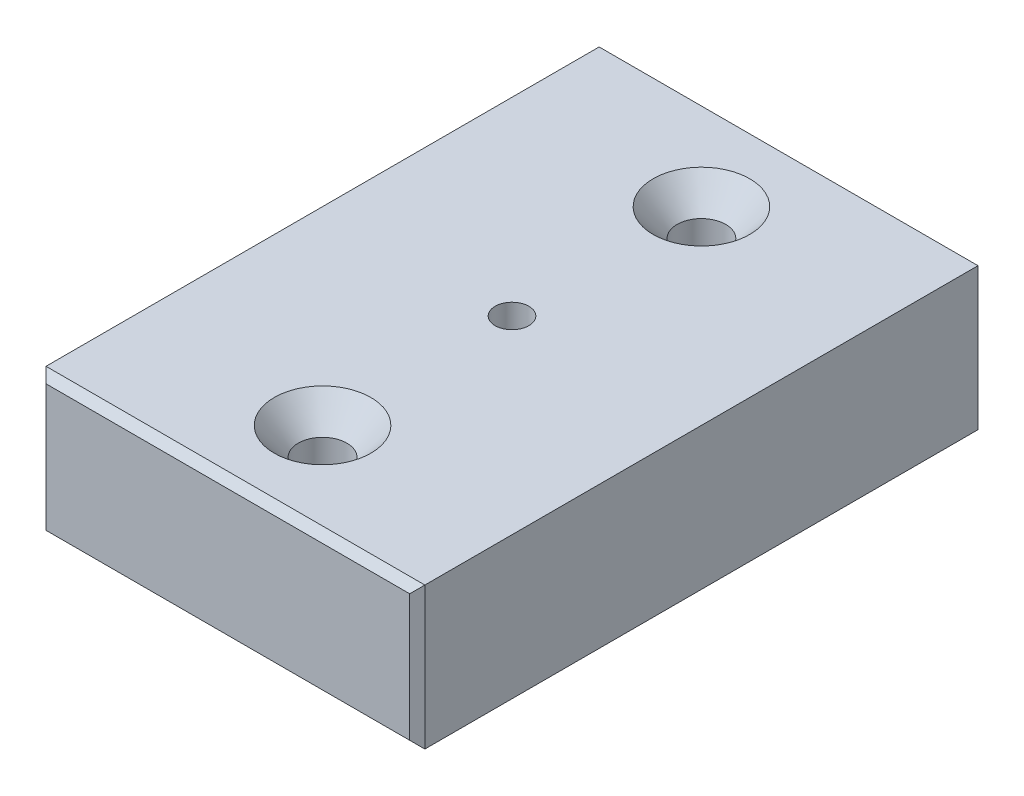
ISO-10303-21;
HEADER;
FILE_DESCRIPTION(('STEP AP214'),'2;1');
FILE_NAME('part.step','',(''),(''),'','','');
FILE_SCHEMA(('AUTOMOTIVE_DESIGN { 1 0 10303 214 1 1 1 1 }'));
ENDSEC;
DATA;
#1=APPLICATION_CONTEXT('core data for automotive mechanical design processes');
#2=APPLICATION_PROTOCOL_DEFINITION('international standard','automotive_design',2000,#1);
#3=PRODUCT_CONTEXT('',#1,'mechanical');
#4=PRODUCT('Part','Part','',(#3));
#5=PRODUCT_RELATED_PRODUCT_CATEGORY('part','',(#4));
#6=PRODUCT_DEFINITION_FORMATION('','',#4);
#7=PRODUCT_DEFINITION_CONTEXT('part definition',#1,'design');
#8=PRODUCT_DEFINITION('design','',#6,#7);
#9=PRODUCT_DEFINITION_SHAPE('','',#8);
#10=(LENGTH_UNIT() NAMED_UNIT(*) SI_UNIT(.MILLI.,.METRE.));
#11=(NAMED_UNIT(*) PLANE_ANGLE_UNIT() SI_UNIT($,.RADIAN.));
#12=(NAMED_UNIT(*) SI_UNIT($,.STERADIAN.) SOLID_ANGLE_UNIT());
#13=UNCERTAINTY_MEASURE_WITH_UNIT(LENGTH_MEASURE(1.E-05),#10,'distance_accuracy_value','');
#14=(GEOMETRIC_REPRESENTATION_CONTEXT(3) GLOBAL_UNCERTAINTY_ASSIGNED_CONTEXT((#13)) GLOBAL_UNIT_ASSIGNED_CONTEXT((#10,
#11,#12)) REPRESENTATION_CONTEXT('',''));
#15=CARTESIAN_POINT('',(0.,0.,0.));
#16=DIRECTION('',(0.,0.,1.));
#17=DIRECTION('',(1.,0.,0.));
#18=AXIS2_PLACEMENT_3D('',#15,#16,#17);
#19=CARTESIAN_POINT('',(12.7,4.7625,38.1));
#20=DIRECTION('',(0.,-1.,0.));
#21=DIRECTION('',(1.,0.,0.));
#22=AXIS2_PLACEMENT_3D('',#19,#20,#21);
#23=PLANE('',#22);
#24=CARTESIAN_POINT('',(0.,4.7625,6.34999999999999));
#25=DIRECTION('',(0.,1.,0.));
#26=DIRECTION('',(0.,0.,1.));
#27=AXIS2_PLACEMENT_3D('',#24,#25,#26);
#28=CIRCLE('',#27,3.2385);
#29=CARTESIAN_POINT('',(0.,4.7625,9.58849999999999));
#30=VERTEX_POINT('',#29);
#31=EDGE_CURVE('E400',#30,#30,#28,.T.);
#32=ORIENTED_EDGE('',*,*,#31,.F.);
#33=EDGE_LOOP('',(#32));
#34=FACE_BOUND('',#33,.T.);
#35=CARTESIAN_POINT('',(0.,4.76249999999999,31.75));
#36=DIRECTION('',(0.,1.,0.));
#37=DIRECTION('',(0.,0.,1.));
#38=AXIS2_PLACEMENT_3D('',#35,#36,#37);
#39=CIRCLE('',#38,3.2385);
#40=CARTESIAN_POINT('',(0.,4.76249999999999,34.9885));
#41=VERTEX_POINT('',#40);
#42=EDGE_CURVE('E362',#41,#41,#39,.T.);
#43=ORIENTED_EDGE('',*,*,#42,.F.);
#44=EDGE_LOOP('',(#43));
#45=FACE_BOUND('',#44,.T.);
#46=DIRECTION('',(0.,0.,-1.));
#47=VECTOR('',#46,1.);
#48=CARTESIAN_POINT('',(-12.7,4.76249999999999,38.1));
#49=LINE('',#48,#47);
#50=CARTESIAN_POINT('',(-12.7,4.76249999999999,37.592));
#51=VERTEX_POINT('',#50);
#52=CARTESIAN_POINT('',(-12.7,4.76249999999999,0.508000000000008));
#53=VERTEX_POINT('',#52);
#54=EDGE_CURVE('E374',#51,#53,#49,.T.);
#55=ORIENTED_EDGE('',*,*,#54,.F.);
#56=DIRECTION('',(1.,0.,0.));
#57=VECTOR('',#56,1.);
#58=CARTESIAN_POINT('',(12.7,4.7625,37.592));
#59=LINE('',#58,#57);
#60=CARTESIAN_POINT('',(12.7,4.7625,37.592));
#61=VERTEX_POINT('',#60);
#62=EDGE_CURVE('E110',#51,#61,#59,.T.);
#63=ORIENTED_EDGE('',*,*,#62,.T.);
#64=DIRECTION('',(0.,0.,-1.));
#65=VECTOR('',#64,1.);
#66=CARTESIAN_POINT('',(12.7,4.7625,38.1));
#67=LINE('',#66,#65);
#68=CARTESIAN_POINT('',(12.7,4.76249999999999,0.507999999999981));
#69=VERTEX_POINT('',#68);
#70=EDGE_CURVE('E377',#61,#69,#67,.T.);
#71=ORIENTED_EDGE('',*,*,#70,.T.);
#72=DIRECTION('',(-1.,0.,0.));
#73=VECTOR('',#72,1.);
#74=CARTESIAN_POINT('',(12.7,4.76249999999999,0.507999999999981));
#75=LINE('',#74,#73);
#76=EDGE_CURVE('E129',#69,#53,#75,.T.);
#77=ORIENTED_EDGE('',*,*,#76,.T.);
#78=EDGE_LOOP('',(#55,#63,#71,#77));
#79=FACE_BOUND('',#78,.T.);
#80=CARTESIAN_POINT('',(0.,4.7625,19.05));
#81=DIRECTION('',(0.,1.,0.));
#82=DIRECTION('',(0.,0.,1.));
#83=AXIS2_PLACEMENT_3D('',#80,#81,#82);
#84=CIRCLE('',#83,1.13029999999999);
#85=CARTESIAN_POINT('',(0.,4.7625,20.1803));
#86=VERTEX_POINT('',#85);
#87=EDGE_CURVE('E158',#86,#86,#84,.T.);
#88=ORIENTED_EDGE('',*,*,#87,.F.);
#89=EDGE_LOOP('',(#88));
#90=FACE_BOUND('',#89,.T.);
#91=ADVANCED_FACE('F38',(#34,#45,#79,#90),#23,.F.);
#92=CARTESIAN_POINT('',(-12.7,-4.7625,38.1));
#93=DIRECTION('',(1.,0.,0.));
#94=DIRECTION('',(0.,0.,-1.));
#95=AXIS2_PLACEMENT_3D('',#92,#93,#94);
#96=PLANE('',#95);
#97=DIRECTION('',(0.,0.,-1.));
#98=VECTOR('',#97,1.);
#99=CARTESIAN_POINT('',(-12.7,-4.7625,38.1));
#100=LINE('',#99,#98);
#101=CARTESIAN_POINT('',(-12.7,-4.7625,37.592));
#102=VERTEX_POINT('',#101);
#103=CARTESIAN_POINT('',(-12.7,-4.76250000000002,0.508000000000008));
#104=VERTEX_POINT('',#103);
#105=EDGE_CURVE('E123',#102,#104,#100,.T.);
#106=ORIENTED_EDGE('',*,*,#105,.F.);
#107=DIRECTION('',(0.,1.,0.));
#108=VECTOR('',#107,1.);
#109=CARTESIAN_POINT('',(-12.7,4.76249999999999,37.592));
#110=LINE('',#109,#108);
#111=EDGE_CURVE('E147',#102,#51,#110,.T.);
#112=ORIENTED_EDGE('',*,*,#111,.T.);
#113=ORIENTED_EDGE('',*,*,#54,.T.);
#114=DIRECTION('',(0.,-1.,0.));
#115=VECTOR('',#114,1.);
#116=CARTESIAN_POINT('',(-12.7,-4.76250000000002,0.507999999999981));
#117=LINE('',#116,#115);
#118=EDGE_CURVE('E145',#53,#104,#117,.T.);
#119=ORIENTED_EDGE('',*,*,#118,.T.);
#120=EDGE_LOOP('',(#106,#112,#113,#119));
#121=FACE_BOUND('',#120,.T.);
#122=ADVANCED_FACE('F195',(#121),#96,.F.);
#123=CARTESIAN_POINT('',(12.7,-4.7625,38.1));
#124=DIRECTION('',(0.,1.,0.));
#125=DIRECTION('',(-1.,0.,0.));
#126=AXIS2_PLACEMENT_3D('',#123,#124,#125);
#127=PLANE('',#126);
#128=CARTESIAN_POINT('',(0.,-4.7625,19.05));
#129=DIRECTION('',(0.,1.,0.));
#130=DIRECTION('',(-1.,0.,0.));
#131=AXIS2_PLACEMENT_3D('',#128,#129,#130);
#132=CIRCLE('',#131,1.13029999999999);
#133=CARTESIAN_POINT('',(-1.1303,-4.7625,19.05));
#134=VERTEX_POINT('',#133);
#135=EDGE_CURVE('E397',#134,#134,#132,.T.);
#136=ORIENTED_EDGE('',*,*,#135,.T.);
#137=EDGE_LOOP('',(#136));
#138=FACE_BOUND('',#137,.T.);
#139=CARTESIAN_POINT('',(0.,-4.7625,6.34999999999999));
#140=DIRECTION('',(0.,1.,0.));
#141=DIRECTION('',(-1.,0.,0.));
#142=AXIS2_PLACEMENT_3D('',#139,#140,#141);
#143=CIRCLE('',#142,1.63195);
#144=CARTESIAN_POINT('',(-1.63195000000001,-4.7625,6.34999999999999));
#145=VERTEX_POINT('',#144);
#146=EDGE_CURVE('E363',#145,#145,#143,.T.);
#147=ORIENTED_EDGE('',*,*,#146,.T.);
#148=EDGE_LOOP('',(#147));
#149=FACE_BOUND('',#148,.T.);
#150=CARTESIAN_POINT('',(0.,-4.76250000000002,31.75));
#151=DIRECTION('',(0.,1.,0.));
#152=DIRECTION('',(-1.,0.,0.));
#153=AXIS2_PLACEMENT_3D('',#150,#151,#152);
#154=CIRCLE('',#153,1.63195);
#155=CARTESIAN_POINT('',(-1.63195,-4.76250000000002,31.75));
#156=VERTEX_POINT('',#155);
#157=EDGE_CURVE('E365',#156,#156,#154,.T.);
#158=ORIENTED_EDGE('',*,*,#157,.T.);
#159=EDGE_LOOP('',(#158));
#160=FACE_BOUND('',#159,.T.);
#161=DIRECTION('',(0.,0.,-1.));
#162=VECTOR('',#161,1.);
#163=CARTESIAN_POINT('',(12.7,-4.7625,38.1));
#164=LINE('',#163,#162);
#165=CARTESIAN_POINT('',(12.7,-4.7625,37.592));
#166=VERTEX_POINT('',#165);
#167=CARTESIAN_POINT('',(12.7,-4.7625,0.507999999999981));
#168=VERTEX_POINT('',#167);
#169=EDGE_CURVE('E380',#166,#168,#164,.T.);
#170=ORIENTED_EDGE('',*,*,#169,.F.);
#171=DIRECTION('',(-1.,0.,0.));
#172=VECTOR('',#171,1.);
#173=CARTESIAN_POINT('',(-12.7,-4.7625,37.592));
#174=LINE('',#173,#172);
#175=EDGE_CURVE('E143',#166,#102,#174,.T.);
#176=ORIENTED_EDGE('',*,*,#175,.T.);
#177=ORIENTED_EDGE('',*,*,#105,.T.);
#178=DIRECTION('',(1.,0.,0.));
#179=VECTOR('',#178,1.);
#180=CARTESIAN_POINT('',(12.7,-4.7625,0.507999999999981));
#181=LINE('',#180,#179);
#182=EDGE_CURVE('E140',#104,#168,#181,.T.);
#183=ORIENTED_EDGE('',*,*,#182,.T.);
#184=EDGE_LOOP('',(#170,#176,#177,#183));
#185=FACE_BOUND('',#184,.T.);
#186=ADVANCED_FACE('F200',(#138,#149,#160,#185),#127,.F.);
#187=CARTESIAN_POINT('',(12.7,-4.7625,38.1));
#188=DIRECTION('',(-1.,0.,0.));
#189=DIRECTION('',(0.,0.,1.));
#190=AXIS2_PLACEMENT_3D('',#187,#188,#189);
#191=PLANE('',#190);
#192=ORIENTED_EDGE('',*,*,#70,.F.);
#193=DIRECTION('',(0.,-1.,0.));
#194=VECTOR('',#193,1.);
#195=CARTESIAN_POINT('',(12.7,-4.7625,37.592));
#196=LINE('',#195,#194);
#197=EDGE_CURVE('E138',#61,#166,#196,.T.);
#198=ORIENTED_EDGE('',*,*,#197,.T.);
#199=ORIENTED_EDGE('',*,*,#169,.T.);
#200=DIRECTION('',(0.,1.,0.));
#201=VECTOR('',#200,1.);
#202=CARTESIAN_POINT('',(12.7,-4.7625,0.507999999999981));
#203=LINE('',#202,#201);
#204=EDGE_CURVE('E136',#168,#69,#203,.T.);
#205=ORIENTED_EDGE('',*,*,#204,.T.);
#206=EDGE_LOOP('',(#192,#198,#199,#205));
#207=FACE_BOUND('',#206,.T.);
#208=ADVANCED_FACE('F191',(#207),#191,.F.);
#209=CARTESIAN_POINT('',(0.,0.,38.1));
#210=DIRECTION('',(0.,0.,1.));
#211=DIRECTION('',(1.,0.,0.));
#212=AXIS2_PLACEMENT_3D('',#209,#210,#211);
#213=PLANE('',#212);
#214=DIRECTION('',(0.,1.,0.));
#215=VECTOR('',#214,1.);
#216=CARTESIAN_POINT('',(12.192,4.7625,38.1));
#217=LINE('',#216,#215);
#218=CARTESIAN_POINT('',(12.192,-4.25449999999999,38.1));
#219=VERTEX_POINT('',#218);
#220=CARTESIAN_POINT('',(12.192,4.25449999999999,38.1));
#221=VERTEX_POINT('',#220);
#222=EDGE_CURVE('E127',#219,#221,#217,.T.);
#223=ORIENTED_EDGE('',*,*,#222,.T.);
#224=DIRECTION('',(-1.,0.,0.));
#225=VECTOR('',#224,1.);
#226=CARTESIAN_POINT('',(-12.7,4.25449999999999,38.1));
#227=LINE('',#226,#225);
#228=CARTESIAN_POINT('',(-12.192,4.25449999999999,38.1));
#229=VERTEX_POINT('',#228);
#230=EDGE_CURVE('E108',#221,#229,#227,.T.);
#231=ORIENTED_EDGE('',*,*,#230,.T.);
#232=DIRECTION('',(0.,-1.,0.));
#233=VECTOR('',#232,1.);
#234=CARTESIAN_POINT('',(-12.192,-4.7625,38.1));
#235=LINE('',#234,#233);
#236=CARTESIAN_POINT('',(-12.192,-4.25450000000001,38.1));
#237=VERTEX_POINT('',#236);
#238=EDGE_CURVE('E116',#229,#237,#235,.T.);
#239=ORIENTED_EDGE('',*,*,#238,.T.);
#240=DIRECTION('',(1.,0.,0.));
#241=VECTOR('',#240,1.);
#242=CARTESIAN_POINT('',(12.7,-4.25449999999999,38.1));
#243=LINE('',#242,#241);
#244=EDGE_CURVE('E122',#237,#219,#243,.T.);
#245=ORIENTED_EDGE('',*,*,#244,.T.);
#246=EDGE_LOOP('',(#223,#231,#239,#245));
#247=FACE_BOUND('',#246,.T.);
#248=ADVANCED_FACE('F125',(#247),#213,.T.);
#249=CARTESIAN_POINT('',(0.,0.,0.));
#250=DIRECTION('',(0.,0.,1.));
#251=DIRECTION('',(1.,0.,0.));
#252=AXIS2_PLACEMENT_3D('',#249,#250,#251);
#253=PLANE('',#252);
#254=DIRECTION('',(0.,-1.,0.));
#255=VECTOR('',#254,1.);
#256=CARTESIAN_POINT('',(12.192,0.,0.));
#257=LINE('',#256,#255);
#258=CARTESIAN_POINT('',(12.192,4.25449999999999,0.));
#259=VERTEX_POINT('',#258);
#260=CARTESIAN_POINT('',(12.192,-4.25450000000001,0.));
#261=VERTEX_POINT('',#260);
#262=EDGE_CURVE('E47',#259,#261,#257,.T.);
#263=ORIENTED_EDGE('',*,*,#262,.T.);
#264=DIRECTION('',(-1.,0.,0.));
#265=VECTOR('',#264,1.);
#266=CARTESIAN_POINT('',(0.,-4.25449999999999,0.));
#267=LINE('',#266,#265);
#268=CARTESIAN_POINT('',(-12.192,-4.25450000000001,0.));
#269=VERTEX_POINT('',#268);
#270=EDGE_CURVE('E11',#261,#269,#267,.T.);
#271=ORIENTED_EDGE('',*,*,#270,.T.);
#272=DIRECTION('',(0.,1.,0.));
#273=VECTOR('',#272,1.);
#274=CARTESIAN_POINT('',(-12.192,0.,0.));
#275=LINE('',#274,#273);
#276=CARTESIAN_POINT('',(-12.192,4.25449999999999,0.));
#277=VERTEX_POINT('',#276);
#278=EDGE_CURVE('E149',#269,#277,#275,.T.);
#279=ORIENTED_EDGE('',*,*,#278,.T.);
#280=DIRECTION('',(1.,0.,0.));
#281=VECTOR('',#280,1.);
#282=CARTESIAN_POINT('',(0.,4.25449999999999,0.));
#283=LINE('',#282,#281);
#284=EDGE_CURVE('E58',#277,#259,#283,.T.);
#285=ORIENTED_EDGE('',*,*,#284,.T.);
#286=EDGE_LOOP('',(#263,#271,#279,#285));
#287=FACE_BOUND('',#286,.T.);
#288=ADVANCED_FACE('F180',(#287),#253,.F.);
#289=CARTESIAN_POINT('',(0.,4.76249999999999,31.75));
#290=DIRECTION('',(0.,1.,0.));
#291=DIRECTION('',(0.,0.,1.));
#292=AXIS2_PLACEMENT_3D('',#289,#290,#291);
#293=CYLINDRICAL_SURFACE('',#292,1.63195);
#294=ORIENTED_EDGE('',*,*,#157,.F.);
#295=EDGE_LOOP('',(#294));
#296=FACE_BOUND('',#295,.T.);
#297=CARTESIAN_POINT('',(0.,2.91437563537908,31.75));
#298=DIRECTION('',(0.,1.,0.));
#299=DIRECTION('',(0.,0.,1.));
#300=AXIS2_PLACEMENT_3D('',#297,#298,#299);
#301=CIRCLE('',#300,1.63195);
#302=CARTESIAN_POINT('',(0.,2.91437563537908,33.38195));
#303=VERTEX_POINT('',#302);
#304=EDGE_CURVE('E359',#303,#303,#301,.T.);
#305=ORIENTED_EDGE('',*,*,#304,.T.);
#306=EDGE_LOOP('',(#305));
#307=FACE_BOUND('',#306,.T.);
#308=ADVANCED_FACE('F182',(#296,#307),#293,.F.);
#309=CARTESIAN_POINT('',(0.,4.76249999999999,31.75));
#310=DIRECTION('',(0.,1.,0.));
#311=DIRECTION('',(0.,0.,1.));
#312=AXIS2_PLACEMENT_3D('',#309,#310,#311);
#313=CONICAL_SURFACE('',#312,3.2385,0.715584993317675);
#314=ORIENTED_EDGE('',*,*,#304,.F.);
#315=EDGE_LOOP('',(#314));
#316=FACE_BOUND('',#315,.T.);
#317=ORIENTED_EDGE('',*,*,#42,.T.);
#318=EDGE_LOOP('',(#317));
#319=FACE_BOUND('',#318,.T.);
#320=ADVANCED_FACE('F188',(#316,#319),#313,.F.);
#321=CARTESIAN_POINT('',(0.,4.7625,6.34999999999999));
#322=DIRECTION('',(0.,1.,0.));
#323=DIRECTION('',(0.,0.,1.));
#324=AXIS2_PLACEMENT_3D('',#321,#322,#323);
#325=CYLINDRICAL_SURFACE('',#324,1.63195);
#326=ORIENTED_EDGE('',*,*,#146,.F.);
#327=EDGE_LOOP('',(#326));
#328=FACE_BOUND('',#327,.T.);
#329=CARTESIAN_POINT('',(0.,2.91437563537908,6.34999999999999));
#330=DIRECTION('',(0.,1.,0.));
#331=DIRECTION('',(0.,0.,1.));
#332=AXIS2_PLACEMENT_3D('',#329,#330,#331);
#333=CIRCLE('',#332,1.63195);
#334=CARTESIAN_POINT('',(0.,2.91437563537908,7.98194999999999));
#335=VERTEX_POINT('',#334);
#336=EDGE_CURVE('E368',#335,#335,#333,.T.);
#337=ORIENTED_EDGE('',*,*,#336,.T.);
#338=EDGE_LOOP('',(#337));
#339=FACE_BOUND('',#338,.T.);
#340=ADVANCED_FACE('F264',(#328,#339),#325,.F.);
#341=CARTESIAN_POINT('',(0.,4.7625,6.34999999999999));
#342=DIRECTION('',(0.,1.,0.));
#343=DIRECTION('',(0.,0.,1.));
#344=AXIS2_PLACEMENT_3D('',#341,#342,#343);
#345=CONICAL_SURFACE('',#344,3.2385,0.715584993317675);
#346=ORIENTED_EDGE('',*,*,#336,.F.);
#347=EDGE_LOOP('',(#346));
#348=FACE_BOUND('',#347,.T.);
#349=ORIENTED_EDGE('',*,*,#31,.T.);
#350=EDGE_LOOP('',(#349));
#351=FACE_BOUND('',#350,.T.);
#352=ADVANCED_FACE('F256',(#348,#351),#345,.F.);
#353=CARTESIAN_POINT('',(0.,4.7625,19.05));
#354=DIRECTION('',(0.,1.,0.));
#355=DIRECTION('',(0.,0.,1.));
#356=AXIS2_PLACEMENT_3D('',#353,#354,#355);
#357=CYLINDRICAL_SURFACE('',#356,1.13029999999999);
#358=ORIENTED_EDGE('',*,*,#135,.F.);
#359=EDGE_LOOP('',(#358));
#360=FACE_BOUND('',#359,.T.);
#361=ORIENTED_EDGE('',*,*,#87,.T.);
#362=EDGE_LOOP('',(#361));
#363=FACE_BOUND('',#362,.T.);
#364=ADVANCED_FACE('F223',(#360,#363),#357,.F.);
#365=CARTESIAN_POINT('',(0.,-4.25450000000001,38.1));
#366=DIRECTION('',(0.,-0.707106781186547,0.707106781186547));
#367=DIRECTION('',(-1.,0.,0.));
#368=AXIS2_PLACEMENT_3D('',#365,#366,#367);
#369=PLANE('',#368);
#370=DIRECTION('',(0.577350269189626,0.577350269189626,0.577350269189626));
#371=VECTOR('',#370,1.);
#372=CARTESIAN_POINT('',(-10.7738333333333,-2.83633333333334,39.5181666666667));
#373=LINE('',#372,#371);
#374=EDGE_CURVE('E119',#102,#237,#373,.T.);
#375=ORIENTED_EDGE('',*,*,#374,.F.);
#376=ORIENTED_EDGE('',*,*,#175,.F.);
#377=DIRECTION('',(-0.577350269189626,0.577350269189626,0.577350269189626));
#378=VECTOR('',#377,1.);
#379=CARTESIAN_POINT('',(8.128,-0.190499999999996,42.164));
#380=LINE('',#379,#378);
#381=EDGE_CURVE('E155',#219,#166,#380,.F.);
#382=ORIENTED_EDGE('',*,*,#381,.F.);
#383=ORIENTED_EDGE('',*,*,#244,.F.);
#384=EDGE_LOOP('',(#375,#376,#382,#383));
#385=FACE_BOUND('',#384,.T.);
#386=ADVANCED_FACE('F219',(#385),#369,.T.);
#387=CARTESIAN_POINT('',(12.192,0.,38.1));
#388=DIRECTION('',(0.707106781186547,0.,0.707106781186547));
#389=DIRECTION('',(0.,-1.,0.));
#390=AXIS2_PLACEMENT_3D('',#387,#388,#389);
#391=PLANE('',#390);
#392=ORIENTED_EDGE('',*,*,#381,.T.);
#393=ORIENTED_EDGE('',*,*,#197,.F.);
#394=DIRECTION('',(-0.577350269189626,-0.577350269189626,0.577350269189626));
#395=VECTOR('',#394,1.);
#396=CARTESIAN_POINT('',(10.7738333333333,2.83633333333333,39.5181666666667));
#397=LINE('',#396,#395);
#398=EDGE_CURVE('E113',#221,#61,#397,.F.);
#399=ORIENTED_EDGE('',*,*,#398,.F.);
#400=ORIENTED_EDGE('',*,*,#222,.F.);
#401=EDGE_LOOP('',(#392,#393,#399,#400));
#402=FACE_BOUND('',#401,.T.);
#403=ADVANCED_FACE('F216',(#402),#391,.T.);
#404=CARTESIAN_POINT('',(-12.192,0.,38.1));
#405=DIRECTION('',(-0.707106781186547,0.,0.707106781186547));
#406=DIRECTION('',(0.,1.,0.));
#407=AXIS2_PLACEMENT_3D('',#404,#405,#406);
#408=PLANE('',#407);
#409=ORIENTED_EDGE('',*,*,#374,.T.);
#410=ORIENTED_EDGE('',*,*,#238,.F.);
#411=DIRECTION('',(-0.577350269189626,0.577350269189626,-0.577350269189626));
#412=VECTOR('',#411,1.);
#413=CARTESIAN_POINT('',(-10.7738333333333,2.83633333333333,39.5181666666667));
#414=LINE('',#413,#412);
#415=EDGE_CURVE('E104',#51,#229,#414,.F.);
#416=ORIENTED_EDGE('',*,*,#415,.F.);
#417=ORIENTED_EDGE('',*,*,#111,.F.);
#418=EDGE_LOOP('',(#409,#410,#416,#417));
#419=FACE_BOUND('',#418,.T.);
#420=ADVANCED_FACE('F117',(#419),#408,.T.);
#421=CARTESIAN_POINT('',(0.,4.25449999999998,38.1));
#422=DIRECTION('',(0.,0.707106781186547,0.707106781186547));
#423=DIRECTION('',(1.,0.,0.));
#424=AXIS2_PLACEMENT_3D('',#421,#422,#423);
#425=PLANE('',#424);
#426=ORIENTED_EDGE('',*,*,#398,.T.);
#427=ORIENTED_EDGE('',*,*,#62,.F.);
#428=ORIENTED_EDGE('',*,*,#415,.T.);
#429=ORIENTED_EDGE('',*,*,#230,.F.);
#430=EDGE_LOOP('',(#426,#427,#428,#429));
#431=FACE_BOUND('',#430,.T.);
#432=ADVANCED_FACE('F106',(#431),#425,.T.);
#433=CARTESIAN_POINT('',(12.7,4.76249999999999,0.507999999999981));
#434=DIRECTION('',(0.,-0.707106781186543,0.707106781186552));
#435=DIRECTION('',(-1.,0.,0.));
#436=AXIS2_PLACEMENT_3D('',#433,#434,#435);
#437=PLANE('',#436);
#438=DIRECTION('',(-0.577350269189628,-0.577350269189629,-0.57735026918962));
#439=VECTOR('',#438,1.);
#440=CARTESIAN_POINT('',(12.7,4.76249999999999,0.507999999999981));
#441=LINE('',#440,#439);
#442=EDGE_CURVE('E162',#259,#69,#441,.F.);
#443=ORIENTED_EDGE('',*,*,#442,.F.);
#444=ORIENTED_EDGE('',*,*,#284,.F.);
#445=DIRECTION('',(0.577350269189628,-0.577350269189628,-0.577350269189621));
#446=VECTOR('',#445,1.);
#447=CARTESIAN_POINT('',(-9.52499999999997,1.58749999999996,-2.667));
#448=LINE('',#447,#446);
#449=EDGE_CURVE('E42',#53,#277,#448,.T.);
#450=ORIENTED_EDGE('',*,*,#449,.F.);
#451=ORIENTED_EDGE('',*,*,#76,.F.);
#452=EDGE_LOOP('',(#443,#444,#450,#451));
#453=FACE_BOUND('',#452,.T.);
#454=ADVANCED_FACE('F40',(#453),#437,.F.);
#455=CARTESIAN_POINT('',(-12.7,-4.76250000000002,0.507999999999981));
#456=DIRECTION('',(0.707106781186543,0.,0.707106781186552));
#457=DIRECTION('',(0.,-1.,0.));
#458=AXIS2_PLACEMENT_3D('',#455,#456,#457);
#459=PLANE('',#458);
#460=ORIENTED_EDGE('',*,*,#449,.T.);
#461=ORIENTED_EDGE('',*,*,#278,.F.);
#462=DIRECTION('',(-0.577350269189628,-0.577350269189628,0.577350269189621));
#463=VECTOR('',#462,1.);
#464=CARTESIAN_POINT('',(-12.7,-4.76250000000002,0.507999999999981));
#465=LINE('',#464,#463);
#466=EDGE_CURVE('E161',#104,#269,#465,.F.);
#467=ORIENTED_EDGE('',*,*,#466,.F.);
#468=ORIENTED_EDGE('',*,*,#118,.F.);
#469=EDGE_LOOP('',(#460,#461,#467,#468));
#470=FACE_BOUND('',#469,.T.);
#471=ADVANCED_FACE('F171',(#470),#459,.F.);
#472=CARTESIAN_POINT('',(12.7,-4.7625,0.507999999999981));
#473=DIRECTION('',(-0.707106781186543,0.,0.707106781186552));
#474=DIRECTION('',(0.,1.,0.));
#475=AXIS2_PLACEMENT_3D('',#472,#473,#474);
#476=PLANE('',#475);
#477=ORIENTED_EDGE('',*,*,#442,.T.);
#478=ORIENTED_EDGE('',*,*,#204,.F.);
#479=DIRECTION('',(-0.577350269189628,0.577350269189628,-0.577350269189621));
#480=VECTOR('',#479,1.);
#481=CARTESIAN_POINT('',(12.7,-4.7625,0.507999999999981));
#482=LINE('',#481,#480);
#483=EDGE_CURVE('E159',#261,#168,#482,.F.);
#484=ORIENTED_EDGE('',*,*,#483,.F.);
#485=ORIENTED_EDGE('',*,*,#262,.F.);
#486=EDGE_LOOP('',(#477,#478,#484,#485));
#487=FACE_BOUND('',#486,.T.);
#488=ADVANCED_FACE('F176',(#487),#476,.F.);
#489=CARTESIAN_POINT('',(12.7,-4.7625,0.507999999999981));
#490=DIRECTION('',(0.,0.707106781186543,0.707106781186552));
#491=DIRECTION('',(1.,0.,0.));
#492=AXIS2_PLACEMENT_3D('',#489,#490,#491);
#493=PLANE('',#492);
#494=ORIENTED_EDGE('',*,*,#466,.T.);
#495=ORIENTED_EDGE('',*,*,#270,.F.);
#496=ORIENTED_EDGE('',*,*,#483,.T.);
#497=ORIENTED_EDGE('',*,*,#182,.F.);
#498=EDGE_LOOP('',(#494,#495,#496,#497));
#499=FACE_BOUND('',#498,.T.);
#500=ADVANCED_FACE('F179',(#499),#493,.F.);
#501=CLOSED_SHELL('',(#91,#122,#186,#208,#248,#288,#308,#320,#340,#352,#364,#386,#403,#420,#432,
#454,#471,#488,#500));
#502=MANIFOLD_SOLID_BREP('B2',#501);
#503=ADVANCED_BREP_SHAPE_REPRESENTATION('',(#18,#502),#14);
#504=SHAPE_DEFINITION_REPRESENTATION(#9,#503);
ENDSEC;
END-ISO-10303-21;
